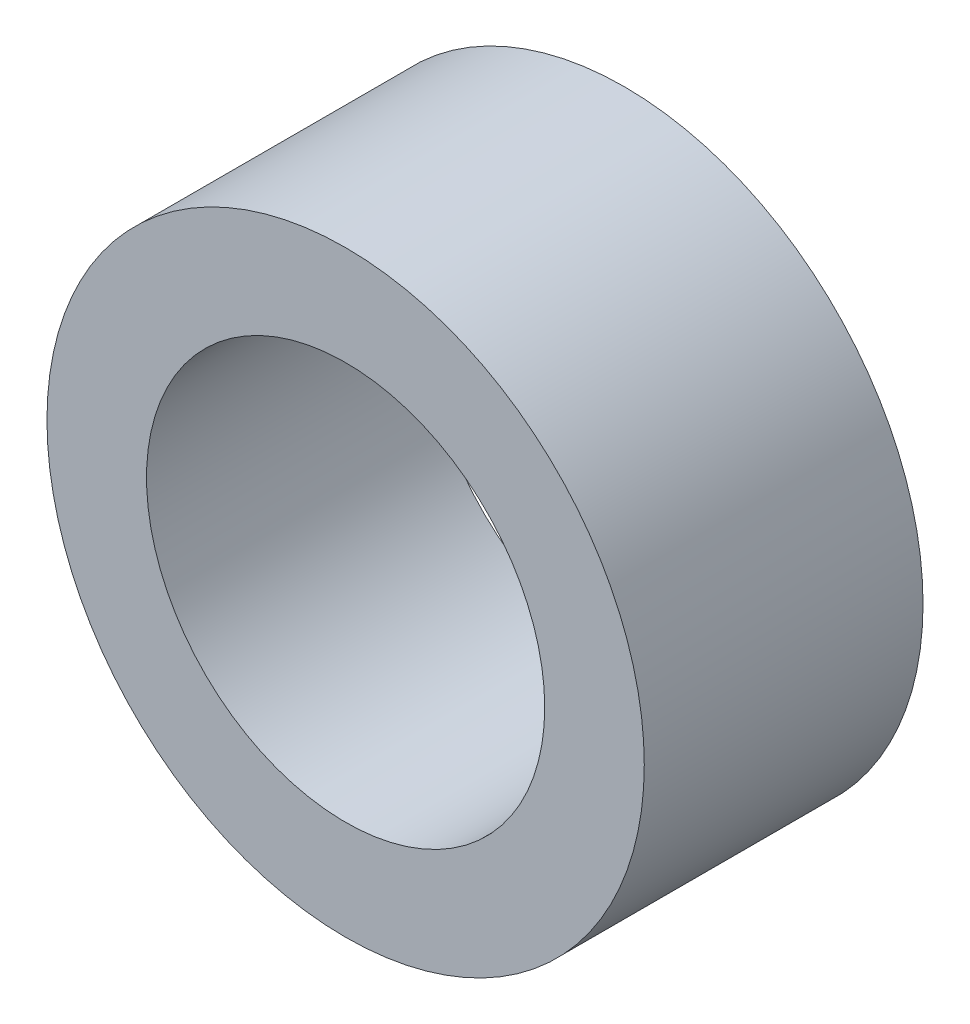
ISO-10303-21;
HEADER;
FILE_DESCRIPTION(('STEP AP214'),'2;1');
FILE_NAME('part.step','',(''),(''),'','','');
FILE_SCHEMA(('AUTOMOTIVE_DESIGN { 1 0 10303 214 1 1 1 1 }'));
ENDSEC;
DATA;
#1=APPLICATION_CONTEXT('core data for automotive mechanical design processes');
#2=APPLICATION_PROTOCOL_DEFINITION('international standard','automotive_design',2000,#1);
#3=PRODUCT_CONTEXT('',#1,'mechanical');
#4=PRODUCT('Part','Part','',(#3));
#5=PRODUCT_RELATED_PRODUCT_CATEGORY('part','',(#4));
#6=PRODUCT_DEFINITION_FORMATION('','',#4);
#7=PRODUCT_DEFINITION_CONTEXT('part definition',#1,'design');
#8=PRODUCT_DEFINITION('design','',#6,#7);
#9=PRODUCT_DEFINITION_SHAPE('','',#8);
#10=(LENGTH_UNIT() NAMED_UNIT(*) SI_UNIT(.MILLI.,.METRE.));
#11=(NAMED_UNIT(*) PLANE_ANGLE_UNIT() SI_UNIT($,.RADIAN.));
#12=(NAMED_UNIT(*) SI_UNIT($,.STERADIAN.) SOLID_ANGLE_UNIT());
#13=UNCERTAINTY_MEASURE_WITH_UNIT(LENGTH_MEASURE(1.E-05),#10,'distance_accuracy_value','');
#14=(GEOMETRIC_REPRESENTATION_CONTEXT(3) GLOBAL_UNCERTAINTY_ASSIGNED_CONTEXT((#13)) GLOBAL_UNIT_ASSIGNED_CONTEXT((#10,
#11,#12)) REPRESENTATION_CONTEXT('',''));
#15=CARTESIAN_POINT('',(0.,0.,0.));
#16=DIRECTION('',(0.,0.,1.));
#17=DIRECTION('',(1.,0.,0.));
#18=AXIS2_PLACEMENT_3D('',#15,#16,#17);
#19=CARTESIAN_POINT('',(0.,0.,14.));
#20=DIRECTION('',(0.,0.,1.));
#21=DIRECTION('',(1.,0.,0.));
#22=AXIS2_PLACEMENT_3D('',#19,#20,#21);
#23=PLANE('',#22);
#24=CARTESIAN_POINT('',(0.,0.,14.));
#25=DIRECTION('',(0.,0.,1.));
#26=DIRECTION('',(1.,0.,0.));
#27=AXIS2_PLACEMENT_3D('',#24,#25,#26);
#28=CIRCLE('',#27,30.);
#29=CARTESIAN_POINT('',(30.,0.,14.));
#30=VERTEX_POINT('',#29);
#31=EDGE_CURVE('E10',#30,#30,#28,.T.);
#32=ORIENTED_EDGE('',*,*,#31,.T.);
#33=EDGE_LOOP('',(#32));
#34=FACE_BOUND('',#33,.T.);
#35=CARTESIAN_POINT('',(0.,0.,14.));
#36=DIRECTION('',(0.,0.,1.));
#37=DIRECTION('',(1.,0.,0.));
#38=AXIS2_PLACEMENT_3D('',#35,#36,#37);
#39=CIRCLE('',#38,20.);
#40=CARTESIAN_POINT('',(20.,0.,14.));
#41=VERTEX_POINT('',#40);
#42=EDGE_CURVE('E54',#41,#41,#39,.T.);
#43=ORIENTED_EDGE('',*,*,#42,.F.);
#44=EDGE_LOOP('',(#43));
#45=FACE_BOUND('',#44,.T.);
#46=ADVANCED_FACE('F41',(#34,#45),#23,.T.);
#47=CARTESIAN_POINT('',(0.,0.,-14.));
#48=DIRECTION('',(0.,0.,1.));
#49=DIRECTION('',(1.,0.,0.));
#50=AXIS2_PLACEMENT_3D('',#47,#48,#49);
#51=PLANE('',#50);
#52=CARTESIAN_POINT('',(0.,0.,-14.));
#53=DIRECTION('',(0.,0.,1.));
#54=DIRECTION('',(1.,0.,0.));
#55=AXIS2_PLACEMENT_3D('',#52,#53,#54);
#56=CIRCLE('',#55,30.);
#57=CARTESIAN_POINT('',(30.,0.,-14.));
#58=VERTEX_POINT('',#57);
#59=EDGE_CURVE('E45',#58,#58,#56,.T.);
#60=ORIENTED_EDGE('',*,*,#59,.F.);
#61=EDGE_LOOP('',(#60));
#62=FACE_BOUND('',#61,.T.);
#63=CARTESIAN_POINT('',(0.,0.,-14.));
#64=DIRECTION('',(0.,0.,1.));
#65=DIRECTION('',(1.,0.,0.));
#66=AXIS2_PLACEMENT_3D('',#63,#64,#65);
#67=CIRCLE('',#66,20.);
#68=CARTESIAN_POINT('',(20.,0.,-14.));
#69=VERTEX_POINT('',#68);
#70=EDGE_CURVE('E56',#69,#69,#67,.T.);
#71=ORIENTED_EDGE('',*,*,#70,.T.);
#72=EDGE_LOOP('',(#71));
#73=FACE_BOUND('',#72,.T.);
#74=ADVANCED_FACE('F68',(#62,#73),#51,.F.);
#75=CARTESIAN_POINT('',(0.,0.,14.));
#76=DIRECTION('',(0.,0.,-1.));
#77=DIRECTION('',(-1.,0.,0.));
#78=AXIS2_PLACEMENT_3D('',#75,#76,#77);
#79=CYLINDRICAL_SURFACE('',#78,30.);
#80=ORIENTED_EDGE('',*,*,#31,.F.);
#81=EDGE_LOOP('',(#80));
#82=FACE_BOUND('',#81,.T.);
#83=ORIENTED_EDGE('',*,*,#59,.T.);
#84=EDGE_LOOP('',(#83));
#85=FACE_BOUND('',#84,.T.);
#86=ADVANCED_FACE('F43',(#82,#85),#79,.T.);
#87=CARTESIAN_POINT('',(0.,0.,14.));
#88=DIRECTION('',(0.,0.,-1.));
#89=DIRECTION('',(-1.,0.,0.));
#90=AXIS2_PLACEMENT_3D('',#87,#88,#89);
#91=CYLINDRICAL_SURFACE('',#90,20.);
#92=ORIENTED_EDGE('',*,*,#42,.T.);
#93=EDGE_LOOP('',(#92));
#94=FACE_BOUND('',#93,.T.);
#95=ORIENTED_EDGE('',*,*,#70,.F.);
#96=EDGE_LOOP('',(#95));
#97=FACE_BOUND('',#96,.T.);
#98=ADVANCED_FACE('F64',(#94,#97),#91,.F.);
#99=CLOSED_SHELL('',(#46,#74,#86,#98));
#100=MANIFOLD_SOLID_BREP('B2',#99);
#101=ADVANCED_BREP_SHAPE_REPRESENTATION('',(#18,#100),#14);
#102=SHAPE_DEFINITION_REPRESENTATION(#9,#101);
ENDSEC;
END-ISO-10303-21;
